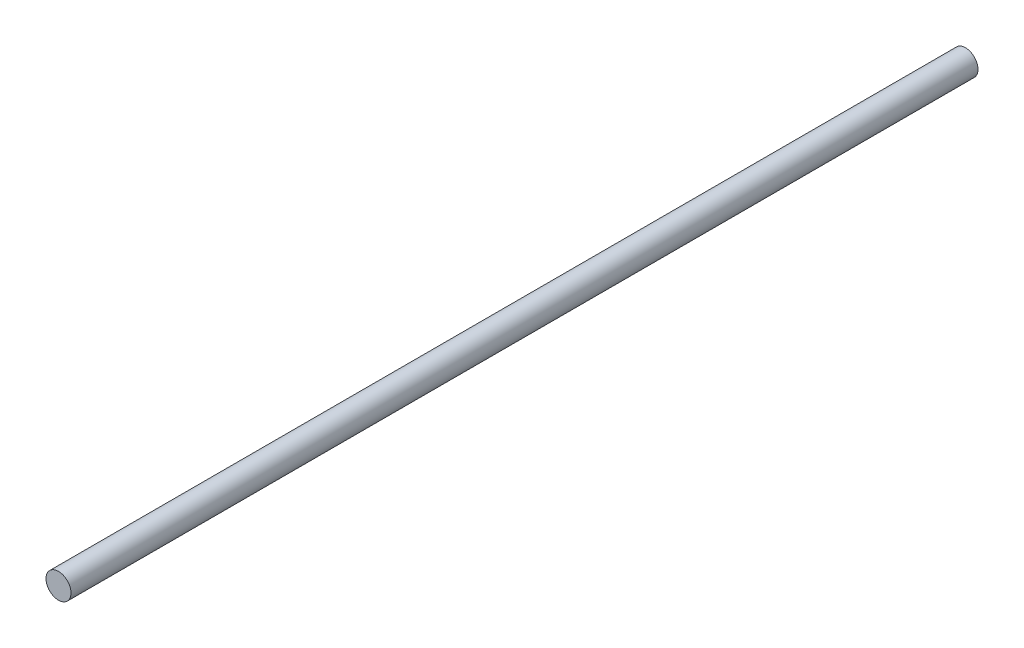
ISO-10303-21;
HEADER;
FILE_DESCRIPTION(('STEP AP214'),'2;1');
FILE_NAME('part.step','',(''),(''),'','','');
FILE_SCHEMA(('AUTOMOTIVE_DESIGN { 1 0 10303 214 1 1 1 1 }'));
ENDSEC;
DATA;
#1=APPLICATION_CONTEXT('core data for automotive mechanical design processes');
#2=APPLICATION_PROTOCOL_DEFINITION('international standard','automotive_design',2000,#1);
#3=PRODUCT_CONTEXT('',#1,'mechanical');
#4=PRODUCT('Part','Part','',(#3));
#5=PRODUCT_RELATED_PRODUCT_CATEGORY('part','',(#4));
#6=PRODUCT_DEFINITION_FORMATION('','',#4);
#7=PRODUCT_DEFINITION_CONTEXT('part definition',#1,'design');
#8=PRODUCT_DEFINITION('design','',#6,#7);
#9=PRODUCT_DEFINITION_SHAPE('','',#8);
#10=(LENGTH_UNIT() NAMED_UNIT(*) SI_UNIT(.MILLI.,.METRE.));
#11=(NAMED_UNIT(*) PLANE_ANGLE_UNIT() SI_UNIT($,.RADIAN.));
#12=(NAMED_UNIT(*) SI_UNIT($,.STERADIAN.) SOLID_ANGLE_UNIT());
#13=UNCERTAINTY_MEASURE_WITH_UNIT(LENGTH_MEASURE(1.E-05),#10,'distance_accuracy_value','');
#14=(GEOMETRIC_REPRESENTATION_CONTEXT(3) GLOBAL_UNCERTAINTY_ASSIGNED_CONTEXT((#13)) GLOBAL_UNIT_ASSIGNED_CONTEXT((#10,
#11,#12)) REPRESENTATION_CONTEXT('',''));
#15=CARTESIAN_POINT('',(0.,0.,0.));
#16=DIRECTION('',(0.,0.,1.));
#17=DIRECTION('',(1.,0.,0.));
#18=AXIS2_PLACEMENT_3D('',#15,#16,#17);
#19=CARTESIAN_POINT('',(0.,0.,-290.));
#20=DIRECTION('',(0.,0.,1.));
#21=DIRECTION('',(1.,0.,0.));
#22=AXIS2_PLACEMENT_3D('',#19,#20,#21);
#23=CYLINDRICAL_SURFACE('',#22,4.);
#24=CARTESIAN_POINT('',(0.,0.,-290.));
#25=DIRECTION('',(0.,0.,1.));
#26=DIRECTION('',(1.,0.,0.));
#27=AXIS2_PLACEMENT_3D('',#24,#25,#26);
#28=CIRCLE('',#27,4.);
#29=CARTESIAN_POINT('',(4.,0.,-290.));
#30=VERTEX_POINT('',#29);
#31=EDGE_CURVE('E10',#30,#30,#28,.T.);
#32=ORIENTED_EDGE('',*,*,#31,.T.);
#33=EDGE_LOOP('',(#32));
#34=FACE_BOUND('',#33,.T.);
#35=CARTESIAN_POINT('',(0.,0.,0.));
#36=DIRECTION('',(0.,0.,1.));
#37=DIRECTION('',(1.,0.,0.));
#38=AXIS2_PLACEMENT_3D('',#35,#36,#37);
#39=CIRCLE('',#38,4.);
#40=CARTESIAN_POINT('',(4.,0.,0.));
#41=VERTEX_POINT('',#40);
#42=EDGE_CURVE('E33',#41,#41,#39,.T.);
#43=ORIENTED_EDGE('',*,*,#42,.F.);
#44=EDGE_LOOP('',(#43));
#45=FACE_BOUND('',#44,.T.);
#46=ADVANCED_FACE('F30',(#34,#45),#23,.T.);
#47=CARTESIAN_POINT('',(0.,0.,-290.));
#48=DIRECTION('',(0.,0.,1.));
#49=DIRECTION('',(1.,0.,0.));
#50=AXIS2_PLACEMENT_3D('',#47,#48,#49);
#51=PLANE('',#50);
#52=ORIENTED_EDGE('',*,*,#31,.F.);
#53=EDGE_LOOP('',(#52));
#54=FACE_BOUND('',#53,.T.);
#55=ADVANCED_FACE('F45',(#54),#51,.F.);
#56=CARTESIAN_POINT('',(0.,0.,0.));
#57=DIRECTION('',(0.,0.,1.));
#58=DIRECTION('',(1.,0.,0.));
#59=AXIS2_PLACEMENT_3D('',#56,#57,#58);
#60=PLANE('',#59);
#61=ORIENTED_EDGE('',*,*,#42,.T.);
#62=EDGE_LOOP('',(#61));
#63=FACE_BOUND('',#62,.T.);
#64=ADVANCED_FACE('F42',(#63),#60,.T.);
#65=CLOSED_SHELL('',(#46,#55,#64));
#66=MANIFOLD_SOLID_BREP('B2',#65);
#67=ADVANCED_BREP_SHAPE_REPRESENTATION('',(#18,#66),#14);
#68=SHAPE_DEFINITION_REPRESENTATION(#9,#67);
ENDSEC;
END-ISO-10303-21;
